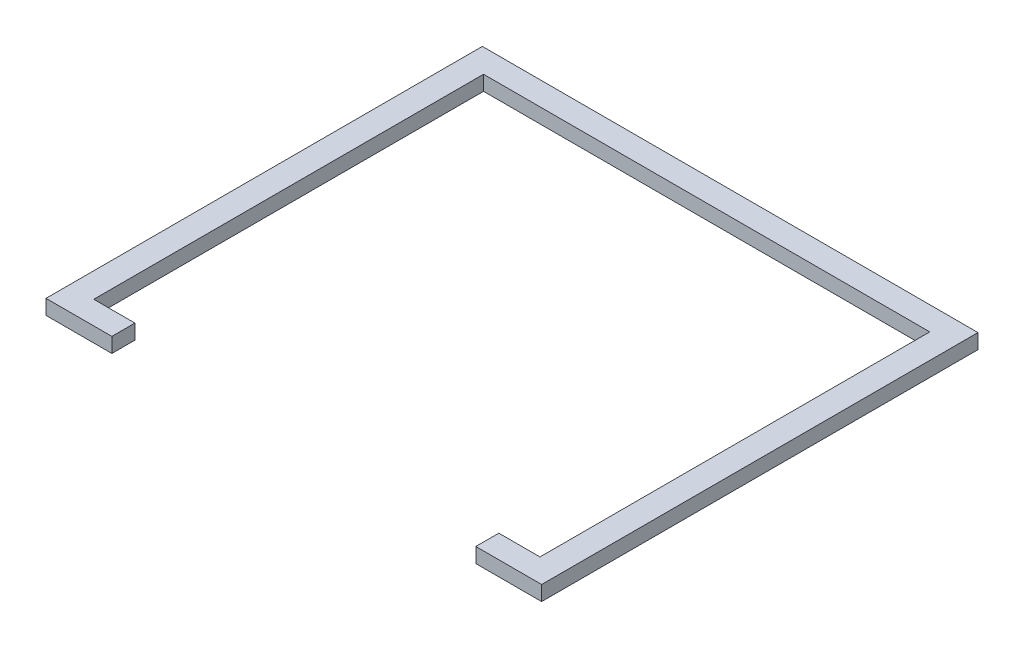
ISO-10303-21;
HEADER;
FILE_DESCRIPTION(('STEP AP214'),'2;1');
FILE_NAME('part.step','',(''),(''),'','','');
FILE_SCHEMA(('AUTOMOTIVE_DESIGN { 1 0 10303 214 1 1 1 1 }'));
ENDSEC;
DATA;
#1=APPLICATION_CONTEXT('core data for automotive mechanical design processes');
#2=APPLICATION_PROTOCOL_DEFINITION('international standard','automotive_design',2000,#1);
#3=PRODUCT_CONTEXT('',#1,'mechanical');
#4=PRODUCT('Part','Part','',(#3));
#5=PRODUCT_RELATED_PRODUCT_CATEGORY('part','',(#4));
#6=PRODUCT_DEFINITION_FORMATION('','',#4);
#7=PRODUCT_DEFINITION_CONTEXT('part definition',#1,'design');
#8=PRODUCT_DEFINITION('design','',#6,#7);
#9=PRODUCT_DEFINITION_SHAPE('','',#8);
#10=(LENGTH_UNIT() NAMED_UNIT(*) SI_UNIT(.MILLI.,.METRE.));
#11=(NAMED_UNIT(*) PLANE_ANGLE_UNIT() SI_UNIT($,.RADIAN.));
#12=(NAMED_UNIT(*) SI_UNIT($,.STERADIAN.) SOLID_ANGLE_UNIT());
#13=UNCERTAINTY_MEASURE_WITH_UNIT(LENGTH_MEASURE(1.E-05),#10,'distance_accuracy_value','');
#14=(GEOMETRIC_REPRESENTATION_CONTEXT(3) GLOBAL_UNCERTAINTY_ASSIGNED_CONTEXT((#13)) GLOBAL_UNIT_ASSIGNED_CONTEXT((#10,
#11,#12)) REPRESENTATION_CONTEXT('',''));
#15=CARTESIAN_POINT('',(0.,0.,0.));
#16=DIRECTION('',(0.,0.,1.));
#17=DIRECTION('',(1.,0.,0.));
#18=AXIS2_PLACEMENT_3D('',#15,#16,#17);
#19=CARTESIAN_POINT('',(-1401.5859734892,90.,1568.30245831181));
#20=DIRECTION('',(-1.,0.,0.));
#21=DIRECTION('',(0.,0.,1.));
#22=AXIS2_PLACEMENT_3D('',#19,#20,#21);
#23=PLANE('',#22);
#24=DIRECTION('',(0.,0.,-1.));
#25=VECTOR('',#24,1.);
#26=CARTESIAN_POINT('',(-1401.5859734892,0.,1568.30245831181));
#27=LINE('',#26,#25);
#28=CARTESIAN_POINT('',(-1401.5859734892,0.,1568.30245831181));
#29=VERTEX_POINT('',#28);
#30=CARTESIAN_POINT('',(-1401.5859734892,0.,1428.30245831181));
#31=VERTEX_POINT('',#30);
#32=EDGE_CURVE('E155',#29,#31,#27,.T.);
#33=ORIENTED_EDGE('',*,*,#32,.T.);
#34=DIRECTION('',(0.,-1.,0.));
#35=VECTOR('',#34,1.);
#36=CARTESIAN_POINT('',(-1401.5859734892,90.,1428.30245831181));
#37=LINE('',#36,#35);
#38=CARTESIAN_POINT('',(-1401.5859734892,90.,1428.30245831181));
#39=VERTEX_POINT('',#38);
#40=EDGE_CURVE('E11',#39,#31,#37,.T.);
#41=ORIENTED_EDGE('',*,*,#40,.F.);
#42=DIRECTION('',(0.,0.,-1.));
#43=VECTOR('',#42,1.);
#44=CARTESIAN_POINT('',(-1401.5859734892,90.,1568.30245831181));
#45=LINE('',#44,#43);
#46=CARTESIAN_POINT('',(-1401.5859734892,90.,1568.30245831181));
#47=VERTEX_POINT('',#46);
#48=EDGE_CURVE('E177',#47,#39,#45,.T.);
#49=ORIENTED_EDGE('',*,*,#48,.F.);
#50=DIRECTION('',(0.,-1.,0.));
#51=VECTOR('',#50,1.);
#52=CARTESIAN_POINT('',(-1401.5859734892,90.,1568.30245831181));
#53=LINE('',#52,#51);
#54=EDGE_CURVE('E151',#47,#29,#53,.T.);
#55=ORIENTED_EDGE('',*,*,#54,.T.);
#56=EDGE_LOOP('',(#33,#41,#49,#55));
#57=FACE_BOUND('',#56,.T.);
#58=ADVANCED_FACE('F35',(#57),#23,.F.);
#59=CARTESIAN_POINT('',(-1401.5859734892,90.,1428.30245831181));
#60=DIRECTION('',(0.,0.,1.));
#61=DIRECTION('',(1.,0.,0.));
#62=AXIS2_PLACEMENT_3D('',#59,#60,#61);
#63=PLANE('',#62);
#64=DIRECTION('',(-1.,0.,0.));
#65=VECTOR('',#64,1.);
#66=CARTESIAN_POINT('',(-1401.5859734892,0.,1428.30245831181));
#67=LINE('',#66,#65);
#68=CARTESIAN_POINT('',(-1651.5859734892,0.,1428.30245831181));
#69=VERTEX_POINT('',#68);
#70=EDGE_CURVE('E158',#31,#69,#67,.T.);
#71=ORIENTED_EDGE('',*,*,#70,.T.);
#72=DIRECTION('',(0.,-1.,0.));
#73=VECTOR('',#72,1.);
#74=CARTESIAN_POINT('',(-1651.5859734892,90.,1428.30245831181));
#75=LINE('',#74,#73);
#76=CARTESIAN_POINT('',(-1651.5859734892,90.,1428.30245831181));
#77=VERTEX_POINT('',#76);
#78=EDGE_CURVE('E43',#77,#69,#75,.T.);
#79=ORIENTED_EDGE('',*,*,#78,.F.);
#80=DIRECTION('',(-1.,0.,0.));
#81=VECTOR('',#80,1.);
#82=CARTESIAN_POINT('',(-1401.5859734892,90.,1428.30245831181));
#83=LINE('',#82,#81);
#84=EDGE_CURVE('E106',#39,#77,#83,.T.);
#85=ORIENTED_EDGE('',*,*,#84,.F.);
#86=ORIENTED_EDGE('',*,*,#40,.T.);
#87=EDGE_LOOP('',(#71,#79,#85,#86));
#88=FACE_BOUND('',#87,.T.);
#89=ADVANCED_FACE('F255',(#88),#63,.F.);
#90=CARTESIAN_POINT('',(-1651.5859734892,90.,1428.30245831181));
#91=DIRECTION('',(-1.,0.,0.));
#92=DIRECTION('',(0.,0.,1.));
#93=AXIS2_PLACEMENT_3D('',#90,#91,#92);
#94=PLANE('',#93);
#95=DIRECTION('',(0.,0.,-1.));
#96=VECTOR('',#95,1.);
#97=CARTESIAN_POINT('',(-1651.5859734892,0.,1428.30245831181));
#98=LINE('',#97,#96);
#99=CARTESIAN_POINT('',(-1651.5859734892,0.,-938.784218378143));
#100=VERTEX_POINT('',#99);
#101=EDGE_CURVE('E160',#69,#100,#98,.T.);
#102=ORIENTED_EDGE('',*,*,#101,.T.);
#103=DIRECTION('',(0.,-1.,0.));
#104=VECTOR('',#103,1.);
#105=CARTESIAN_POINT('',(-1651.5859734892,90.,-938.784218378143));
#106=LINE('',#105,#104);
#107=CARTESIAN_POINT('',(-1651.5859734892,90.,-938.784218378143));
#108=VERTEX_POINT('',#107);
#109=EDGE_CURVE('E196',#108,#100,#106,.T.);
#110=ORIENTED_EDGE('',*,*,#109,.F.);
#111=DIRECTION('',(0.,0.,-1.));
#112=VECTOR('',#111,1.);
#113=CARTESIAN_POINT('',(-1651.5859734892,90.,1428.30245831181));
#114=LINE('',#113,#112);
#115=EDGE_CURVE('E204',#77,#108,#114,.T.);
#116=ORIENTED_EDGE('',*,*,#115,.F.);
#117=ORIENTED_EDGE('',*,*,#78,.T.);
#118=EDGE_LOOP('',(#102,#110,#116,#117));
#119=FACE_BOUND('',#118,.T.);
#120=ADVANCED_FACE('F202',(#119),#94,.F.);
#121=CARTESIAN_POINT('',(-1651.5859734892,90.,-938.784218378143));
#122=DIRECTION('',(0.,0.,-1.));
#123=DIRECTION('',(-1.,0.,0.));
#124=AXIS2_PLACEMENT_3D('',#121,#122,#123);
#125=PLANE('',#124);
#126=DIRECTION('',(1.,0.,0.));
#127=VECTOR('',#126,1.);
#128=CARTESIAN_POINT('',(-1651.5859734892,0.,-938.784218378143));
#129=LINE('',#128,#127);
#130=CARTESIAN_POINT('',(1058.37960083556,0.,-938.784218378143));
#131=VERTEX_POINT('',#130);
#132=EDGE_CURVE('E162',#100,#131,#129,.T.);
#133=ORIENTED_EDGE('',*,*,#132,.T.);
#134=DIRECTION('',(0.,-1.,0.));
#135=VECTOR('',#134,1.);
#136=CARTESIAN_POINT('',(1058.37960083556,90.,-938.784218378143));
#137=LINE('',#136,#135);
#138=CARTESIAN_POINT('',(1058.37960083556,90.,-938.784218378143));
#139=VERTEX_POINT('',#138);
#140=EDGE_CURVE('E193',#139,#131,#137,.T.);
#141=ORIENTED_EDGE('',*,*,#140,.F.);
#142=DIRECTION('',(1.,0.,0.));
#143=VECTOR('',#142,1.);
#144=CARTESIAN_POINT('',(-1651.5859734892,90.,-938.784218378143));
#145=LINE('',#144,#143);
#146=EDGE_CURVE('E222',#108,#139,#145,.T.);
#147=ORIENTED_EDGE('',*,*,#146,.F.);
#148=ORIENTED_EDGE('',*,*,#109,.T.);
#149=EDGE_LOOP('',(#133,#141,#147,#148));
#150=FACE_BOUND('',#149,.T.);
#151=ADVANCED_FACE('F213',(#150),#125,.F.);
#152=CARTESIAN_POINT('',(1058.37960083556,90.,-938.784218378143));
#153=DIRECTION('',(1.,0.,0.));
#154=DIRECTION('',(0.,0.,-1.));
#155=AXIS2_PLACEMENT_3D('',#152,#153,#154);
#156=PLANE('',#155);
#157=DIRECTION('',(0.,0.,1.));
#158=VECTOR('',#157,1.);
#159=CARTESIAN_POINT('',(1058.37960083556,0.,-938.784218378143));
#160=LINE('',#159,#158);
#161=CARTESIAN_POINT('',(1058.37960083556,0.,1428.30245831181));
#162=VERTEX_POINT('',#161);
#163=EDGE_CURVE('E164',#131,#162,#160,.T.);
#164=ORIENTED_EDGE('',*,*,#163,.T.);
#165=DIRECTION('',(0.,-1.,0.));
#166=VECTOR('',#165,1.);
#167=CARTESIAN_POINT('',(1058.37960083556,90.,1428.30245831181));
#168=LINE('',#167,#166);
#169=CARTESIAN_POINT('',(1058.37960083556,90.,1428.30245831181));
#170=VERTEX_POINT('',#169);
#171=EDGE_CURVE('E190',#170,#162,#168,.T.);
#172=ORIENTED_EDGE('',*,*,#171,.F.);
#173=DIRECTION('',(0.,0.,1.));
#174=VECTOR('',#173,1.);
#175=CARTESIAN_POINT('',(1058.37960083556,90.,-938.784218378143));
#176=LINE('',#175,#174);
#177=EDGE_CURVE('E219',#139,#170,#176,.T.);
#178=ORIENTED_EDGE('',*,*,#177,.F.);
#179=ORIENTED_EDGE('',*,*,#140,.T.);
#180=EDGE_LOOP('',(#164,#172,#178,#179));
#181=FACE_BOUND('',#180,.T.);
#182=ADVANCED_FACE('F217',(#181),#156,.F.);
#183=CARTESIAN_POINT('',(1058.37960083556,90.,1428.30245831181));
#184=DIRECTION('',(0.,0.,1.));
#185=DIRECTION('',(1.,0.,0.));
#186=AXIS2_PLACEMENT_3D('',#183,#184,#185);
#187=PLANE('',#186);
#188=DIRECTION('',(-1.,0.,0.));
#189=VECTOR('',#188,1.);
#190=CARTESIAN_POINT('',(1058.37960083556,0.,1428.30245831181));
#191=LINE('',#190,#189);
#192=CARTESIAN_POINT('',(808.379600835564,0.,1428.30245831181));
#193=VERTEX_POINT('',#192);
#194=EDGE_CURVE('E166',#162,#193,#191,.T.);
#195=ORIENTED_EDGE('',*,*,#194,.T.);
#196=DIRECTION('',(0.,-1.,0.));
#197=VECTOR('',#196,1.);
#198=CARTESIAN_POINT('',(808.379600835564,90.,1428.30245831181));
#199=LINE('',#198,#197);
#200=CARTESIAN_POINT('',(808.379600835564,90.,1428.30245831181));
#201=VERTEX_POINT('',#200);
#202=EDGE_CURVE('E187',#201,#193,#199,.T.);
#203=ORIENTED_EDGE('',*,*,#202,.F.);
#204=DIRECTION('',(-1.,0.,0.));
#205=VECTOR('',#204,1.);
#206=CARTESIAN_POINT('',(1058.37960083556,90.,1428.30245831181));
#207=LINE('',#206,#205);
#208=EDGE_CURVE('E221',#170,#201,#207,.T.);
#209=ORIENTED_EDGE('',*,*,#208,.F.);
#210=ORIENTED_EDGE('',*,*,#171,.T.);
#211=EDGE_LOOP('',(#195,#203,#209,#210));
#212=FACE_BOUND('',#211,.T.);
#213=ADVANCED_FACE('F268',(#212),#187,.F.);
#214=CARTESIAN_POINT('',(808.379600835564,90.,1428.30245831181));
#215=DIRECTION('',(1.,0.,0.));
#216=DIRECTION('',(0.,0.,-1.));
#217=AXIS2_PLACEMENT_3D('',#214,#215,#216);
#218=PLANE('',#217);
#219=DIRECTION('',(0.,0.,1.));
#220=VECTOR('',#219,1.);
#221=CARTESIAN_POINT('',(808.379600835564,0.,1428.30245831181));
#222=LINE('',#221,#220);
#223=CARTESIAN_POINT('',(808.379600835564,0.,1568.30245831181));
#224=VERTEX_POINT('',#223);
#225=EDGE_CURVE('E168',#193,#224,#222,.T.);
#226=ORIENTED_EDGE('',*,*,#225,.T.);
#227=DIRECTION('',(0.,-1.,0.));
#228=VECTOR('',#227,1.);
#229=CARTESIAN_POINT('',(808.379600835564,90.,1568.30245831181));
#230=LINE('',#229,#228);
#231=CARTESIAN_POINT('',(808.379600835564,90.,1568.30245831181));
#232=VERTEX_POINT('',#231);
#233=EDGE_CURVE('E184',#232,#224,#230,.T.);
#234=ORIENTED_EDGE('',*,*,#233,.F.);
#235=DIRECTION('',(0.,0.,1.));
#236=VECTOR('',#235,1.);
#237=CARTESIAN_POINT('',(808.379600835564,90.,1428.30245831181));
#238=LINE('',#237,#236);
#239=EDGE_CURVE('E224',#201,#232,#238,.T.);
#240=ORIENTED_EDGE('',*,*,#239,.F.);
#241=ORIENTED_EDGE('',*,*,#202,.T.);
#242=EDGE_LOOP('',(#226,#234,#240,#241));
#243=FACE_BOUND('',#242,.T.);
#244=ADVANCED_FACE('F271',(#243),#218,.F.);
#245=CARTESIAN_POINT('',(1208.37960083556,90.,1568.30245831181));
#246=DIRECTION('',(0.,0.,-1.));
#247=DIRECTION('',(-1.,0.,0.));
#248=AXIS2_PLACEMENT_3D('',#245,#246,#247);
#249=PLANE('',#248);
#250=DIRECTION('',(1.,0.,0.));
#251=VECTOR('',#250,1.);
#252=CARTESIAN_POINT('',(1208.37960083556,0.,1568.30245831181));
#253=LINE('',#252,#251);
#254=CARTESIAN_POINT('',(1208.37960083556,0.,1568.30245831181));
#255=VERTEX_POINT('',#254);
#256=EDGE_CURVE('E170',#224,#255,#253,.T.);
#257=ORIENTED_EDGE('',*,*,#256,.T.);
#258=DIRECTION('',(0.,-1.,0.));
#259=VECTOR('',#258,1.);
#260=CARTESIAN_POINT('',(1208.37960083556,90.,1568.30245831181));
#261=LINE('',#260,#259);
#262=CARTESIAN_POINT('',(1208.37960083556,90.,1568.30245831181));
#263=VERTEX_POINT('',#262);
#264=EDGE_CURVE('E181',#263,#255,#261,.T.);
#265=ORIENTED_EDGE('',*,*,#264,.F.);
#266=DIRECTION('',(1.,0.,0.));
#267=VECTOR('',#266,1.);
#268=CARTESIAN_POINT('',(1208.37960083556,90.,1568.30245831181));
#269=LINE('',#268,#267);
#270=EDGE_CURVE('E230',#232,#263,#269,.T.);
#271=ORIENTED_EDGE('',*,*,#270,.F.);
#272=ORIENTED_EDGE('',*,*,#233,.T.);
#273=EDGE_LOOP('',(#257,#265,#271,#272));
#274=FACE_BOUND('',#273,.T.);
#275=ADVANCED_FACE('F236',(#274),#249,.F.);
#276=CARTESIAN_POINT('',(1208.37960083556,90.,-1081.69754168819));
#277=DIRECTION('',(-1.,0.,0.));
#278=DIRECTION('',(0.,0.,1.));
#279=AXIS2_PLACEMENT_3D('',#276,#277,#278);
#280=PLANE('',#279);
#281=DIRECTION('',(0.,0.,-1.));
#282=VECTOR('',#281,1.);
#283=CARTESIAN_POINT('',(1208.37960083556,0.,-1081.69754168819));
#284=LINE('',#283,#282);
#285=CARTESIAN_POINT('',(1208.37960083556,0.,-1081.69754168819));
#286=VERTEX_POINT('',#285);
#287=EDGE_CURVE('E172',#255,#286,#284,.T.);
#288=ORIENTED_EDGE('',*,*,#287,.T.);
#289=DIRECTION('',(0.,-1.,0.));
#290=VECTOR('',#289,1.);
#291=CARTESIAN_POINT('',(1208.37960083556,90.,-1081.69754168819));
#292=LINE('',#291,#290);
#293=CARTESIAN_POINT('',(1208.37960083556,90.,-1081.69754168819));
#294=VERTEX_POINT('',#293);
#295=EDGE_CURVE('E146',#294,#286,#292,.T.);
#296=ORIENTED_EDGE('',*,*,#295,.F.);
#297=DIRECTION('',(0.,0.,-1.));
#298=VECTOR('',#297,1.);
#299=CARTESIAN_POINT('',(1208.37960083556,90.,-1081.69754168819));
#300=LINE('',#299,#298);
#301=EDGE_CURVE('E137',#263,#294,#300,.T.);
#302=ORIENTED_EDGE('',*,*,#301,.F.);
#303=ORIENTED_EDGE('',*,*,#264,.T.);
#304=EDGE_LOOP('',(#288,#296,#302,#303));
#305=FACE_BOUND('',#304,.T.);
#306=ADVANCED_FACE('F240',(#305),#280,.F.);
#307=CARTESIAN_POINT('',(-1801.5859734892,90.,-1081.69754168819));
#308=DIRECTION('',(0.,0.,1.));
#309=DIRECTION('',(1.,0.,0.));
#310=AXIS2_PLACEMENT_3D('',#307,#308,#309);
#311=PLANE('',#310);
#312=DIRECTION('',(-1.,0.,0.));
#313=VECTOR('',#312,1.);
#314=CARTESIAN_POINT('',(-1801.5859734892,0.,-1081.69754168819));
#315=LINE('',#314,#313);
#316=CARTESIAN_POINT('',(-1801.5859734892,0.,-1081.69754168819));
#317=VERTEX_POINT('',#316);
#318=EDGE_CURVE('E145',#286,#317,#315,.T.);
#319=ORIENTED_EDGE('',*,*,#318,.T.);
#320=DIRECTION('',(0.,-1.,0.));
#321=VECTOR('',#320,1.);
#322=CARTESIAN_POINT('',(-1801.5859734892,90.,-1081.69754168819));
#323=LINE('',#322,#321);
#324=CARTESIAN_POINT('',(-1801.5859734892,90.,-1081.69754168819));
#325=VERTEX_POINT('',#324);
#326=EDGE_CURVE('E142',#325,#317,#323,.T.);
#327=ORIENTED_EDGE('',*,*,#326,.F.);
#328=DIRECTION('',(-1.,0.,0.));
#329=VECTOR('',#328,1.);
#330=CARTESIAN_POINT('',(-1801.5859734892,90.,-1081.69754168819));
#331=LINE('',#330,#329);
#332=EDGE_CURVE('E131',#294,#325,#331,.T.);
#333=ORIENTED_EDGE('',*,*,#332,.F.);
#334=ORIENTED_EDGE('',*,*,#295,.T.);
#335=EDGE_LOOP('',(#319,#327,#333,#334));
#336=FACE_BOUND('',#335,.T.);
#337=ADVANCED_FACE('F143',(#336),#311,.F.);
#338=CARTESIAN_POINT('',(-1801.5859734892,90.,1568.30245831181));
#339=DIRECTION('',(1.,0.,0.));
#340=DIRECTION('',(0.,0.,-1.));
#341=AXIS2_PLACEMENT_3D('',#338,#339,#340);
#342=PLANE('',#341);
#343=DIRECTION('',(0.,0.,1.));
#344=VECTOR('',#343,1.);
#345=CARTESIAN_POINT('',(-1801.5859734892,0.,1568.30245831181));
#346=LINE('',#345,#344);
#347=CARTESIAN_POINT('',(-1801.5859734892,0.,1568.30245831181));
#348=VERTEX_POINT('',#347);
#349=EDGE_CURVE('E92',#317,#348,#346,.T.);
#350=ORIENTED_EDGE('',*,*,#349,.T.);
#351=DIRECTION('',(0.,-1.,0.));
#352=VECTOR('',#351,1.);
#353=CARTESIAN_POINT('',(-1801.5859734892,90.,1568.30245831181));
#354=LINE('',#353,#352);
#355=CARTESIAN_POINT('',(-1801.5859734892,90.,1568.30245831181));
#356=VERTEX_POINT('',#355);
#357=EDGE_CURVE('E147',#356,#348,#354,.T.);
#358=ORIENTED_EDGE('',*,*,#357,.F.);
#359=DIRECTION('',(0.,0.,1.));
#360=VECTOR('',#359,1.);
#361=CARTESIAN_POINT('',(-1801.5859734892,90.,1568.30245831181));
#362=LINE('',#361,#360);
#363=EDGE_CURVE('E135',#325,#356,#362,.T.);
#364=ORIENTED_EDGE('',*,*,#363,.F.);
#365=ORIENTED_EDGE('',*,*,#326,.T.);
#366=EDGE_LOOP('',(#350,#358,#364,#365));
#367=FACE_BOUND('',#366,.T.);
#368=ADVANCED_FACE('F149',(#367),#342,.F.);
#369=CARTESIAN_POINT('',(-1401.5859734892,90.,1568.30245831181));
#370=DIRECTION('',(0.,0.,-1.));
#371=DIRECTION('',(-1.,0.,0.));
#372=AXIS2_PLACEMENT_3D('',#369,#370,#371);
#373=PLANE('',#372);
#374=DIRECTION('',(1.,0.,0.));
#375=VECTOR('',#374,1.);
#376=CARTESIAN_POINT('',(-1401.5859734892,0.,1568.30245831181));
#377=LINE('',#376,#375);
#378=EDGE_CURVE('E98',#348,#29,#377,.T.);
#379=ORIENTED_EDGE('',*,*,#378,.T.);
#380=ORIENTED_EDGE('',*,*,#54,.F.);
#381=DIRECTION('',(1.,0.,0.));
#382=VECTOR('',#381,1.);
#383=CARTESIAN_POINT('',(-1401.5859734892,90.,1568.30245831181));
#384=LINE('',#383,#382);
#385=EDGE_CURVE('E51',#356,#47,#384,.T.);
#386=ORIENTED_EDGE('',*,*,#385,.F.);
#387=ORIENTED_EDGE('',*,*,#357,.T.);
#388=EDGE_LOOP('',(#379,#380,#386,#387));
#389=FACE_BOUND('',#388,.T.);
#390=ADVANCED_FACE('F244',(#389),#373,.F.);
#391=CARTESIAN_POINT('',(0.,90.,0.));
#392=DIRECTION('',(0.,1.,0.));
#393=DIRECTION('',(0.,0.,1.));
#394=AXIS2_PLACEMENT_3D('',#391,#392,#393);
#395=PLANE('',#394);
#396=ORIENTED_EDGE('',*,*,#48,.T.);
#397=ORIENTED_EDGE('',*,*,#84,.T.);
#398=ORIENTED_EDGE('',*,*,#115,.T.);
#399=ORIENTED_EDGE('',*,*,#146,.T.);
#400=ORIENTED_EDGE('',*,*,#177,.T.);
#401=ORIENTED_EDGE('',*,*,#208,.T.);
#402=ORIENTED_EDGE('',*,*,#239,.T.);
#403=ORIENTED_EDGE('',*,*,#270,.T.);
#404=ORIENTED_EDGE('',*,*,#301,.T.);
#405=ORIENTED_EDGE('',*,*,#332,.T.);
#406=ORIENTED_EDGE('',*,*,#363,.T.);
#407=ORIENTED_EDGE('',*,*,#385,.T.);
#408=EDGE_LOOP('',(#396,#397,#398,#399,#400,#401,#402,#403,#404,#405,#406,#407));
#409=FACE_BOUND('',#408,.T.);
#410=ADVANCED_FACE('F133',(#409),#395,.T.);
#411=CARTESIAN_POINT('',(0.,0.,0.));
#412=DIRECTION('',(0.,1.,0.));
#413=DIRECTION('',(0.,0.,1.));
#414=AXIS2_PLACEMENT_3D('',#411,#412,#413);
#415=PLANE('',#414);
#416=ORIENTED_EDGE('',*,*,#32,.F.);
#417=ORIENTED_EDGE('',*,*,#378,.F.);
#418=ORIENTED_EDGE('',*,*,#349,.F.);
#419=ORIENTED_EDGE('',*,*,#318,.F.);
#420=ORIENTED_EDGE('',*,*,#287,.F.);
#421=ORIENTED_EDGE('',*,*,#256,.F.);
#422=ORIENTED_EDGE('',*,*,#225,.F.);
#423=ORIENTED_EDGE('',*,*,#194,.F.);
#424=ORIENTED_EDGE('',*,*,#163,.F.);
#425=ORIENTED_EDGE('',*,*,#132,.F.);
#426=ORIENTED_EDGE('',*,*,#101,.F.);
#427=ORIENTED_EDGE('',*,*,#70,.F.);
#428=EDGE_LOOP('',(#416,#417,#418,#419,#420,#421,#422,#423,#424,#425,#426,#427));
#429=FACE_BOUND('',#428,.T.);
#430=ADVANCED_FACE('F208',(#429),#415,.F.);
#431=CLOSED_SHELL('',(#58,#89,#120,#151,#182,#213,#244,#275,#306,#337,#368,#390,#410,#430));
#432=MANIFOLD_SOLID_BREP('B2',#431);
#433=ADVANCED_BREP_SHAPE_REPRESENTATION('',(#18,#432),#14);
#434=SHAPE_DEFINITION_REPRESENTATION(#9,#433);
ENDSEC;
END-ISO-10303-21;
